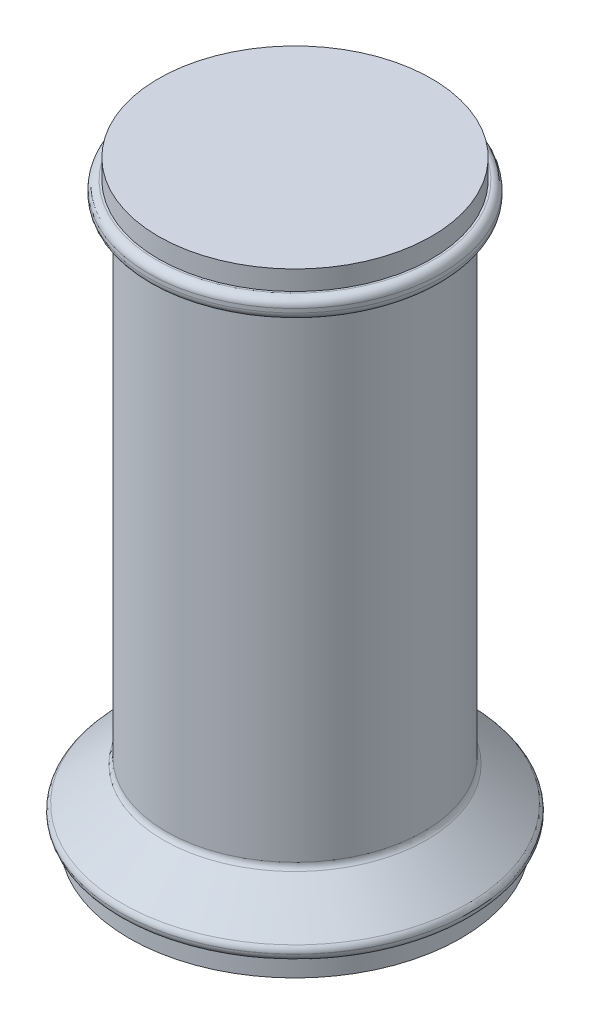
ISO-10303-21;
HEADER;
FILE_DESCRIPTION(('STEP AP214'),'2;1');
FILE_NAME('part.step','',(''),(''),'','','');
FILE_SCHEMA(('AUTOMOTIVE_DESIGN { 1 0 10303 214 1 1 1 1 }'));
ENDSEC;
DATA;
#1=APPLICATION_CONTEXT('core data for automotive mechanical design processes');
#2=APPLICATION_PROTOCOL_DEFINITION('international standard','automotive_design',2000,#1);
#3=PRODUCT_CONTEXT('',#1,'mechanical');
#4=PRODUCT('Part','Part','',(#3));
#5=PRODUCT_RELATED_PRODUCT_CATEGORY('part','',(#4));
#6=PRODUCT_DEFINITION_FORMATION('','',#4);
#7=PRODUCT_DEFINITION_CONTEXT('part definition',#1,'design');
#8=PRODUCT_DEFINITION('design','',#6,#7);
#9=PRODUCT_DEFINITION_SHAPE('','',#8);
#10=(LENGTH_UNIT() NAMED_UNIT(*) SI_UNIT(.MILLI.,.METRE.));
#11=(NAMED_UNIT(*) PLANE_ANGLE_UNIT() SI_UNIT($,.RADIAN.));
#12=(NAMED_UNIT(*) SI_UNIT($,.STERADIAN.) SOLID_ANGLE_UNIT());
#13=UNCERTAINTY_MEASURE_WITH_UNIT(LENGTH_MEASURE(1.E-05),#10,'distance_accuracy_value','');
#14=(GEOMETRIC_REPRESENTATION_CONTEXT(3) GLOBAL_UNCERTAINTY_ASSIGNED_CONTEXT((#13)) GLOBAL_UNIT_ASSIGNED_CONTEXT((#10,
#11,#12)) REPRESENTATION_CONTEXT('',''));
#15=CARTESIAN_POINT('',(0.,0.,0.));
#16=DIRECTION('',(0.,0.,1.));
#17=DIRECTION('',(1.,0.,0.));
#18=AXIS2_PLACEMENT_3D('',#15,#16,#17);
#19=CARTESIAN_POINT('',(0.,5.,0.));
#20=DIRECTION('',(0.,-1.,0.));
#21=DIRECTION('',(0.,0.,-1.));
#22=AXIS2_PLACEMENT_3D('',#19,#20,#21);
#23=CYLINDRICAL_SURFACE('',#22,42.5);
#24=CARTESIAN_POINT('',(0.,5.,0.));
#25=DIRECTION('',(0.,1.,0.));
#26=DIRECTION('',(0.,0.,1.));
#27=AXIS2_PLACEMENT_3D('',#24,#25,#26);
#28=CIRCLE('',#27,42.5);
#29=CARTESIAN_POINT('',(0.,5.,42.5));
#30=VERTEX_POINT('',#29);
#31=EDGE_CURVE('E79',#30,#30,#28,.T.);
#32=ORIENTED_EDGE('',*,*,#31,.F.);
#33=EDGE_LOOP('',(#32));
#34=FACE_BOUND('',#33,.T.);
#35=CARTESIAN_POINT('',(0.,0.,0.));
#36=DIRECTION('',(0.,1.,0.));
#37=DIRECTION('',(0.,0.,1.));
#38=AXIS2_PLACEMENT_3D('',#35,#36,#37);
#39=CIRCLE('',#38,42.5);
#40=CARTESIAN_POINT('',(0.,0.,42.5));
#41=VERTEX_POINT('',#40);
#42=EDGE_CURVE('E80',#41,#41,#39,.T.);
#43=ORIENTED_EDGE('',*,*,#42,.T.);
#44=EDGE_LOOP('',(#43));
#45=FACE_BOUND('',#44,.T.);
#46=ADVANCED_FACE('F35',(#34,#45),#23,.T.);
#47=CARTESIAN_POINT('',(0.,0.,0.));
#48=DIRECTION('',(0.,1.,0.));
#49=DIRECTION('',(0.,0.,1.));
#50=AXIS2_PLACEMENT_3D('',#47,#48,#49);
#51=PLANE('',#50);
#52=ORIENTED_EDGE('',*,*,#42,.F.);
#53=EDGE_LOOP('',(#52));
#54=FACE_BOUND('',#53,.T.);
#55=ADVANCED_FACE('F115',(#54),#51,.F.);
#56=CARTESIAN_POINT('',(0.,8.,0.));
#57=DIRECTION('',(0.,-1.,0.));
#58=DIRECTION('',(0.,0.,-1.));
#59=AXIS2_PLACEMENT_3D('',#56,#57,#58);
#60=CYLINDRICAL_SURFACE('',#59,45.);
#61=CARTESIAN_POINT('',(0.,7.,0.));
#62=DIRECTION('',(0.,1.,0.));
#63=DIRECTION('',(0.,0.,1.));
#64=AXIS2_PLACEMENT_3D('',#61,#62,#63);
#65=CIRCLE('',#64,45.);
#66=CARTESIAN_POINT('',(0.,7.,45.));
#67=VERTEX_POINT('',#66);
#68=EDGE_CURVE('E73',#67,#67,#65,.T.);
#69=ORIENTED_EDGE('',*,*,#68,.T.);
#70=EDGE_LOOP('',(#69));
#71=FACE_BOUND('',#70,.T.);
#72=CARTESIAN_POINT('',(0.,7.06325010803112,0.));
#73=DIRECTION('',(0.,-1.,0.));
#74=DIRECTION('',(0.,0.,-1.));
#75=AXIS2_PLACEMENT_3D('',#72,#73,#74);
#76=CIRCLE('',#75,45.);
#77=CARTESIAN_POINT('',(0.,7.06325010803112,-45.));
#78=VERTEX_POINT('',#77);
#79=EDGE_CURVE('E76',#78,#78,#76,.T.);
#80=ORIENTED_EDGE('',*,*,#79,.T.);
#81=EDGE_LOOP('',(#80));
#82=FACE_BOUND('',#81,.T.);
#83=ADVANCED_FACE('F121',(#71,#82),#60,.T.);
#84=CARTESIAN_POINT('',(0.,5.,0.));
#85=DIRECTION('',(0.,1.,0.));
#86=DIRECTION('',(0.,0.,1.));
#87=AXIS2_PLACEMENT_3D('',#84,#85,#86);
#88=PLANE('',#87);
#89=CARTESIAN_POINT('',(0.,5.,0.));
#90=DIRECTION('',(0.,1.,0.));
#91=DIRECTION('',(0.,0.,1.));
#92=AXIS2_PLACEMENT_3D('',#89,#90,#91);
#93=CIRCLE('',#92,43.);
#94=CARTESIAN_POINT('',(0.,5.,43.));
#95=VERTEX_POINT('',#94);
#96=EDGE_CURVE('E70',#95,#95,#93,.F.);
#97=ORIENTED_EDGE('',*,*,#96,.T.);
#98=EDGE_LOOP('',(#97));
#99=FACE_BOUND('',#98,.T.);
#100=ORIENTED_EDGE('',*,*,#31,.T.);
#101=EDGE_LOOP('',(#100));
#102=FACE_BOUND('',#101,.T.);
#103=ADVANCED_FACE('F227',(#99,#102),#88,.F.);
#104=CARTESIAN_POINT('',(0.,18.,0.));
#105=DIRECTION('',(0.,-1.,0.));
#106=DIRECTION('',(0.,0.,-1.));
#107=AXIS2_PLACEMENT_3D('',#104,#105,#106);
#108=CONICAL_SURFACE('',#107,33.,0.876058050598193);
#109=CARTESIAN_POINT('',(0.,8.59969266722588,0.));
#110=DIRECTION('',(0.,-1.,0.));
#111=DIRECTION('',(0.,0.,-1.));
#112=AXIS2_PLACEMENT_3D('',#109,#110,#111);
#113=CIRCLE('',#112,44.280368799329);
#114=CARTESIAN_POINT('',(0.,8.59969266722588,-44.280368799329));
#115=VERTEX_POINT('',#114);
#116=EDGE_CURVE('E64',#115,#115,#113,.F.);
#117=ORIENTED_EDGE('',*,*,#116,.T.);
#118=EDGE_LOOP('',(#117));
#119=FACE_BOUND('',#118,.T.);
#120=CARTESIAN_POINT('',(0.,17.4003073327741,0.));
#121=DIRECTION('',(0.,1.,0.));
#122=DIRECTION('',(0.,0.,1.));
#123=AXIS2_PLACEMENT_3D('',#120,#121,#122);
#124=CIRCLE('',#123,33.7196312006711);
#125=CARTESIAN_POINT('',(0.,17.4003073327741,33.7196312006711));
#126=VERTEX_POINT('',#125);
#127=EDGE_CURVE('E67',#126,#126,#124,.F.);
#128=ORIENTED_EDGE('',*,*,#127,.T.);
#129=EDGE_LOOP('',(#128));
#130=FACE_BOUND('',#129,.T.);
#131=ADVANCED_FACE('F218',(#119,#130),#108,.T.);
#132=CARTESIAN_POINT('',(0.,142.,0.));
#133=DIRECTION('',(0.,-1.,0.));
#134=DIRECTION('',(0.,0.,-1.));
#135=AXIS2_PLACEMENT_3D('',#132,#133,#134);
#136=CYLINDRICAL_SURFACE('',#135,33.);
#137=CARTESIAN_POINT('',(0.,140.,0.));
#138=DIRECTION('',(0.,1.,0.));
#139=DIRECTION('',(0.,0.,1.));
#140=AXIS2_PLACEMENT_3D('',#137,#138,#139);
#141=CIRCLE('',#140,33.);
#142=CARTESIAN_POINT('',(0.,140.,33.));
#143=VERTEX_POINT('',#142);
#144=EDGE_CURVE('E55',#143,#143,#141,.F.);
#145=ORIENTED_EDGE('',*,*,#144,.T.);
#146=EDGE_LOOP('',(#145));
#147=FACE_BOUND('',#146,.T.);
#148=CARTESIAN_POINT('',(0.,18.9367498919689,0.));
#149=DIRECTION('',(0.,1.,0.));
#150=DIRECTION('',(0.,0.,1.));
#151=AXIS2_PLACEMENT_3D('',#148,#149,#150);
#152=CIRCLE('',#151,33.);
#153=CARTESIAN_POINT('',(0.,18.9367498919689,33.));
#154=VERTEX_POINT('',#153);
#155=EDGE_CURVE('E58',#154,#154,#152,.T.);
#156=ORIENTED_EDGE('',*,*,#155,.T.);
#157=EDGE_LOOP('',(#156));
#158=FACE_BOUND('',#157,.T.);
#159=ADVANCED_FACE('F111',(#147,#158),#136,.T.);
#160=CARTESIAN_POINT('',(0.,147.,0.));
#161=DIRECTION('',(0.,-1.,0.));
#162=DIRECTION('',(0.,0.,-1.));
#163=AXIS2_PLACEMENT_3D('',#160,#161,#162);
#164=CYLINDRICAL_SURFACE('',#163,37.5);
#165=CARTESIAN_POINT('',(0.,144.,0.));
#166=DIRECTION('',(0.,1.,0.));
#167=DIRECTION('',(0.,0.,1.));
#168=AXIS2_PLACEMENT_3D('',#165,#166,#167);
#169=CIRCLE('',#168,37.5);
#170=CARTESIAN_POINT('',(0.,144.,37.5));
#171=VERTEX_POINT('',#170);
#172=EDGE_CURVE('E46',#171,#171,#169,.T.);
#173=ORIENTED_EDGE('',*,*,#172,.T.);
#174=EDGE_LOOP('',(#173));
#175=FACE_BOUND('',#174,.T.);
#176=CARTESIAN_POINT('',(0.,145.,0.));
#177=DIRECTION('',(0.,1.,0.));
#178=DIRECTION('',(0.,0.,1.));
#179=AXIS2_PLACEMENT_3D('',#176,#177,#178);
#180=CIRCLE('',#179,37.5);
#181=CARTESIAN_POINT('',(0.,145.,37.5));
#182=VERTEX_POINT('',#181);
#183=EDGE_CURVE('E50',#182,#182,#180,.F.);
#184=ORIENTED_EDGE('',*,*,#183,.T.);
#185=EDGE_LOOP('',(#184));
#186=FACE_BOUND('',#185,.T.);
#187=ADVANCED_FACE('F103',(#175,#186),#164,.T.);
#188=CARTESIAN_POINT('',(0.,147.,0.));
#189=DIRECTION('',(0.,1.,0.));
#190=DIRECTION('',(0.,0.,1.));
#191=AXIS2_PLACEMENT_3D('',#188,#189,#190);
#192=PLANE('',#191);
#193=CARTESIAN_POINT('',(0.,147.,0.));
#194=DIRECTION('',(0.,1.,0.));
#195=DIRECTION('',(0.,0.,1.));
#196=AXIS2_PLACEMENT_3D('',#193,#194,#195);
#197=CIRCLE('',#196,35.);
#198=CARTESIAN_POINT('',(0.,147.,35.));
#199=VERTEX_POINT('',#198);
#200=EDGE_CURVE('E86',#199,#199,#197,.T.);
#201=ORIENTED_EDGE('',*,*,#200,.F.);
#202=EDGE_LOOP('',(#201));
#203=FACE_BOUND('',#202,.T.);
#204=CARTESIAN_POINT('',(0.,147.,0.));
#205=DIRECTION('',(0.,1.,0.));
#206=DIRECTION('',(0.,0.,1.));
#207=AXIS2_PLACEMENT_3D('',#204,#205,#206);
#208=CIRCLE('',#207,35.5);
#209=CARTESIAN_POINT('',(0.,147.,35.5));
#210=VERTEX_POINT('',#209);
#211=EDGE_CURVE('E11',#210,#210,#208,.T.);
#212=ORIENTED_EDGE('',*,*,#211,.T.);
#213=EDGE_LOOP('',(#212));
#214=FACE_BOUND('',#213,.T.);
#215=ADVANCED_FACE('F100',(#203,#214),#192,.T.);
#216=CARTESIAN_POINT('',(0.,142.,0.));
#217=DIRECTION('',(0.,1.,0.));
#218=DIRECTION('',(0.,0.,1.));
#219=AXIS2_PLACEMENT_3D('',#216,#217,#218);
#220=PLANE('',#219);
#221=CARTESIAN_POINT('',(0.,142.,0.));
#222=DIRECTION('',(0.,1.,0.));
#223=DIRECTION('',(0.,0.,1.));
#224=AXIS2_PLACEMENT_3D('',#221,#222,#223);
#225=CIRCLE('',#224,35.5);
#226=CARTESIAN_POINT('',(0.,142.,35.5));
#227=VERTEX_POINT('',#226);
#228=EDGE_CURVE('E42',#227,#227,#225,.F.);
#229=ORIENTED_EDGE('',*,*,#228,.T.);
#230=EDGE_LOOP('',(#229));
#231=FACE_BOUND('',#230,.T.);
#232=CARTESIAN_POINT('',(0.,142.,0.));
#233=DIRECTION('',(0.,1.,0.));
#234=DIRECTION('',(0.,0.,1.));
#235=AXIS2_PLACEMENT_3D('',#232,#233,#234);
#236=CIRCLE('',#235,35.);
#237=CARTESIAN_POINT('',(0.,142.,35.));
#238=VERTEX_POINT('',#237);
#239=EDGE_CURVE('E61',#238,#238,#236,.T.);
#240=ORIENTED_EDGE('',*,*,#239,.T.);
#241=EDGE_LOOP('',(#240));
#242=FACE_BOUND('',#241,.T.);
#243=ADVANCED_FACE('F102',(#231,#242),#220,.F.);
#244=CARTESIAN_POINT('',(0.,7.,0.));
#245=DIRECTION('',(0.,1.,0.));
#246=DIRECTION('',(0.,0.,1.));
#247=AXIS2_PLACEMENT_3D('',#244,#245,#246);
#248=TOROIDAL_SURFACE('',#247,43.,2.);
#249=ORIENTED_EDGE('',*,*,#96,.F.);
#250=EDGE_LOOP('',(#249));
#251=FACE_BOUND('',#250,.T.);
#252=ORIENTED_EDGE('',*,*,#68,.F.);
#253=EDGE_LOOP('',(#252));
#254=FACE_BOUND('',#253,.T.);
#255=ADVANCED_FACE('F109',(#251,#254),#248,.T.);
#256=CARTESIAN_POINT('',(0.,7.06325010803112,0.));
#257=DIRECTION('',(0.,-1.,0.));
#258=DIRECTION('',(0.,0.,-1.));
#259=AXIS2_PLACEMENT_3D('',#256,#257,#258);
#260=TOROIDAL_SURFACE('',#259,43.,2.);
#261=ORIENTED_EDGE('',*,*,#79,.F.);
#262=EDGE_LOOP('',(#261));
#263=FACE_BOUND('',#262,.T.);
#264=ORIENTED_EDGE('',*,*,#116,.F.);
#265=EDGE_LOOP('',(#264));
#266=FACE_BOUND('',#265,.T.);
#267=ADVANCED_FACE('F130',(#263,#266),#260,.T.);
#268=CARTESIAN_POINT('',(0.,140.,0.));
#269=DIRECTION('',(0.,1.,0.));
#270=DIRECTION('',(0.,0.,1.));
#271=AXIS2_PLACEMENT_3D('',#268,#269,#270);
#272=TOROIDAL_SURFACE('',#271,35.,2.);
#273=ORIENTED_EDGE('',*,*,#144,.F.);
#274=EDGE_LOOP('',(#273));
#275=FACE_BOUND('',#274,.T.);
#276=ORIENTED_EDGE('',*,*,#239,.F.);
#277=EDGE_LOOP('',(#276));
#278=FACE_BOUND('',#277,.T.);
#279=ADVANCED_FACE('F134',(#275,#278),#272,.F.);
#280=CARTESIAN_POINT('',(0.,18.9367498919689,0.));
#281=DIRECTION('',(0.,1.,0.));
#282=DIRECTION('',(0.,0.,1.));
#283=AXIS2_PLACEMENT_3D('',#280,#281,#282);
#284=TOROIDAL_SURFACE('',#283,35.,2.);
#285=ORIENTED_EDGE('',*,*,#127,.F.);
#286=EDGE_LOOP('',(#285));
#287=FACE_BOUND('',#286,.T.);
#288=ORIENTED_EDGE('',*,*,#155,.F.);
#289=EDGE_LOOP('',(#288));
#290=FACE_BOUND('',#289,.T.);
#291=ADVANCED_FACE('F138',(#287,#290),#284,.F.);
#292=CARTESIAN_POINT('',(0.,144.,0.));
#293=DIRECTION('',(0.,1.,0.));
#294=DIRECTION('',(0.,0.,1.));
#295=AXIS2_PLACEMENT_3D('',#292,#293,#294);
#296=TOROIDAL_SURFACE('',#295,35.5,2.);
#297=ORIENTED_EDGE('',*,*,#228,.F.);
#298=EDGE_LOOP('',(#297));
#299=FACE_BOUND('',#298,.T.);
#300=ORIENTED_EDGE('',*,*,#172,.F.);
#301=EDGE_LOOP('',(#300));
#302=FACE_BOUND('',#301,.T.);
#303=ADVANCED_FACE('F141',(#299,#302),#296,.T.);
#304=CARTESIAN_POINT('',(0.,145.,0.));
#305=DIRECTION('',(0.,1.,0.));
#306=DIRECTION('',(0.,0.,1.));
#307=AXIS2_PLACEMENT_3D('',#304,#305,#306);
#308=TOROIDAL_SURFACE('',#307,35.5,2.);
#309=ORIENTED_EDGE('',*,*,#183,.F.);
#310=EDGE_LOOP('',(#309));
#311=FACE_BOUND('',#310,.T.);
#312=ORIENTED_EDGE('',*,*,#211,.F.);
#313=EDGE_LOOP('',(#312));
#314=FACE_BOUND('',#313,.T.);
#315=ADVANCED_FACE('F37',(#311,#314),#308,.T.);
#316=CARTESIAN_POINT('',(0.,152.,0.));
#317=DIRECTION('',(0.,-1.,0.));
#318=DIRECTION('',(0.,0.,-1.));
#319=AXIS2_PLACEMENT_3D('',#316,#317,#318);
#320=CYLINDRICAL_SURFACE('',#319,35.);
#321=CARTESIAN_POINT('',(0.,152.,0.));
#322=DIRECTION('',(0.,1.,0.));
#323=DIRECTION('',(0.,0.,1.));
#324=AXIS2_PLACEMENT_3D('',#321,#322,#323);
#325=CIRCLE('',#324,35.);
#326=CARTESIAN_POINT('',(0.,152.,35.));
#327=VERTEX_POINT('',#326);
#328=EDGE_CURVE('E83',#327,#327,#325,.T.);
#329=ORIENTED_EDGE('',*,*,#328,.F.);
#330=EDGE_LOOP('',(#329));
#331=FACE_BOUND('',#330,.T.);
#332=ORIENTED_EDGE('',*,*,#200,.T.);
#333=EDGE_LOOP('',(#332));
#334=FACE_BOUND('',#333,.T.);
#335=ADVANCED_FACE('F94',(#331,#334),#320,.T.);
#336=CARTESIAN_POINT('',(0.,152.,0.));
#337=DIRECTION('',(0.,1.,0.));
#338=DIRECTION('',(0.,0.,1.));
#339=AXIS2_PLACEMENT_3D('',#336,#337,#338);
#340=PLANE('',#339);
#341=ORIENTED_EDGE('',*,*,#328,.T.);
#342=EDGE_LOOP('',(#341));
#343=FACE_BOUND('',#342,.T.);
#344=ADVANCED_FACE('F92',(#343),#340,.T.);
#345=CLOSED_SHELL('',(#46,#55,#83,#103,#131,#159,#187,#215,#243,#255,#267,#279,#291,#303,#315,
#335,#344));
#346=MANIFOLD_SOLID_BREP('B2',#345);
#347=ADVANCED_BREP_SHAPE_REPRESENTATION('',(#18,#346),#14);
#348=SHAPE_DEFINITION_REPRESENTATION(#9,#347);
ENDSEC;
END-ISO-10303-21;
